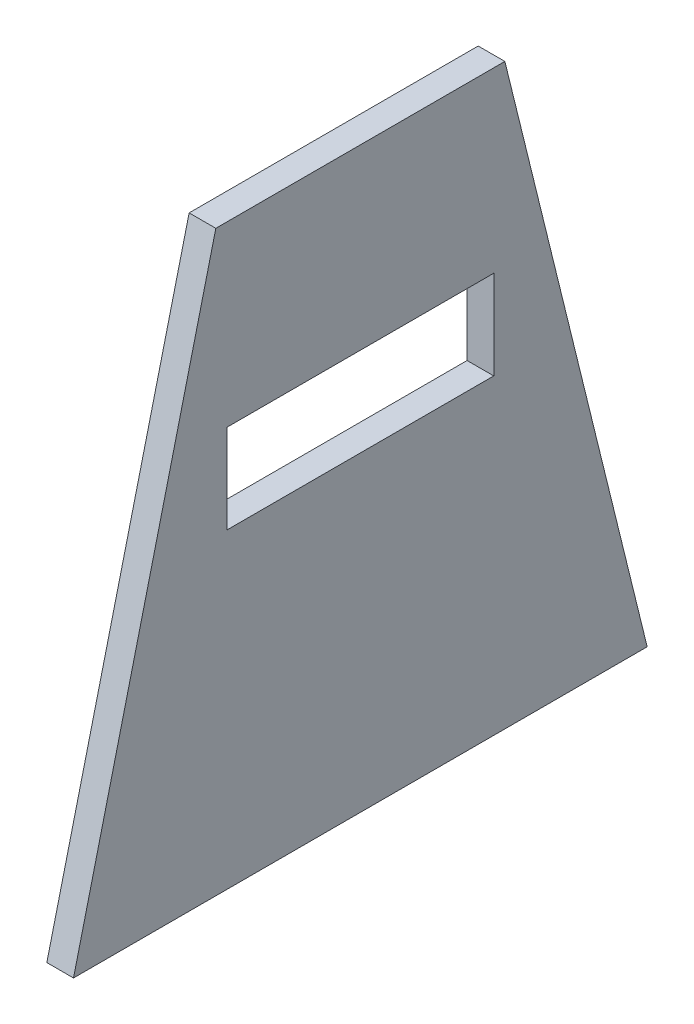
ISO-10303-21;
HEADER;
FILE_DESCRIPTION(('STEP AP214'),'2;1');
FILE_NAME('part.step','',(''),(''),'','','');
FILE_SCHEMA(('AUTOMOTIVE_DESIGN { 1 0 10303 214 1 1 1 1 }'));
ENDSEC;
DATA;
#1=APPLICATION_CONTEXT('core data for automotive mechanical design processes');
#2=APPLICATION_PROTOCOL_DEFINITION('international standard','automotive_design',2000,#1);
#3=PRODUCT_CONTEXT('',#1,'mechanical');
#4=PRODUCT('Part','Part','',(#3));
#5=PRODUCT_RELATED_PRODUCT_CATEGORY('part','',(#4));
#6=PRODUCT_DEFINITION_FORMATION('','',#4);
#7=PRODUCT_DEFINITION_CONTEXT('part definition',#1,'design');
#8=PRODUCT_DEFINITION('design','',#6,#7);
#9=PRODUCT_DEFINITION_SHAPE('','',#8);
#10=(LENGTH_UNIT() NAMED_UNIT(*) SI_UNIT(.MILLI.,.METRE.));
#11=(NAMED_UNIT(*) PLANE_ANGLE_UNIT() SI_UNIT($,.RADIAN.));
#12=(NAMED_UNIT(*) SI_UNIT($,.STERADIAN.) SOLID_ANGLE_UNIT());
#13=UNCERTAINTY_MEASURE_WITH_UNIT(LENGTH_MEASURE(1.E-05),#10,'distance_accuracy_value','');
#14=(GEOMETRIC_REPRESENTATION_CONTEXT(3) GLOBAL_UNCERTAINTY_ASSIGNED_CONTEXT((#13)) GLOBAL_UNIT_ASSIGNED_CONTEXT((#10,
#11,#12)) REPRESENTATION_CONTEXT('',''));
#15=CARTESIAN_POINT('',(0.,0.,0.));
#16=DIRECTION('',(0.,0.,1.));
#17=DIRECTION('',(1.,0.,0.));
#18=AXIS2_PLACEMENT_3D('',#15,#16,#17);
#19=CARTESIAN_POINT('',(3.,-45.,-32.25));
#20=DIRECTION('',(0.,-1.,0.));
#21=DIRECTION('',(0.,0.,-1.));
#22=AXIS2_PLACEMENT_3D('',#19,#20,#21);
#23=PLANE('',#22);
#24=DIRECTION('',(0.,0.,1.));
#25=VECTOR('',#24,1.);
#26=CARTESIAN_POINT('',(0.,-45.,-32.25));
#27=LINE('',#26,#25);
#28=CARTESIAN_POINT('',(0.,-45.,-32.25));
#29=VERTEX_POINT('',#28);
#30=CARTESIAN_POINT('',(0.,-45.,32.25));
#31=VERTEX_POINT('',#30);
#32=EDGE_CURVE('E136',#29,#31,#27,.T.);
#33=ORIENTED_EDGE('',*,*,#32,.F.);
#34=DIRECTION('',(-1.,0.,0.));
#35=VECTOR('',#34,1.);
#36=CARTESIAN_POINT('',(3.,-45.,-32.25));
#37=LINE('',#36,#35);
#38=CARTESIAN_POINT('',(3.,-45.,-32.25));
#39=VERTEX_POINT('',#38);
#40=EDGE_CURVE('E11',#39,#29,#37,.T.);
#41=ORIENTED_EDGE('',*,*,#40,.F.);
#42=DIRECTION('',(0.,0.,1.));
#43=VECTOR('',#42,1.);
#44=CARTESIAN_POINT('',(3.,-45.,-32.25));
#45=LINE('',#44,#43);
#46=CARTESIAN_POINT('',(3.,-45.,32.25));
#47=VERTEX_POINT('',#46);
#48=EDGE_CURVE('E140',#39,#47,#45,.T.);
#49=ORIENTED_EDGE('',*,*,#48,.T.);
#50=DIRECTION('',(-1.,0.,0.));
#51=VECTOR('',#50,1.);
#52=CARTESIAN_POINT('',(3.,-45.,32.25));
#53=LINE('',#52,#51);
#54=EDGE_CURVE('E41',#47,#31,#53,.T.);
#55=ORIENTED_EDGE('',*,*,#54,.T.);
#56=EDGE_LOOP('',(#33,#41,#49,#55));
#57=FACE_BOUND('',#56,.T.);
#58=ADVANCED_FACE('F38',(#57),#23,.T.);
#59=CARTESIAN_POINT('',(3.,20.,-16.25));
#60=DIRECTION('',(0.,0.239019047122404,-0.971014878934766));
#61=DIRECTION('',(0.,0.971014878934766,0.239019047122404));
#62=AXIS2_PLACEMENT_3D('',#59,#60,#61);
#63=PLANE('',#62);
#64=DIRECTION('',(0.,-0.971014878934766,-0.239019047122404));
#65=VECTOR('',#64,1.);
#66=CARTESIAN_POINT('',(0.,20.,-16.25));
#67=LINE('',#66,#65);
#68=CARTESIAN_POINT('',(0.,20.,-16.25));
#69=VERTEX_POINT('',#68);
#70=EDGE_CURVE('E144',#69,#29,#67,.T.);
#71=ORIENTED_EDGE('',*,*,#70,.F.);
#72=DIRECTION('',(-1.,0.,0.));
#73=VECTOR('',#72,1.);
#74=CARTESIAN_POINT('',(3.,20.,-16.25));
#75=LINE('',#74,#73);
#76=CARTESIAN_POINT('',(3.,20.,-16.25));
#77=VERTEX_POINT('',#76);
#78=EDGE_CURVE('E46',#77,#69,#75,.T.);
#79=ORIENTED_EDGE('',*,*,#78,.F.);
#80=DIRECTION('',(0.,-0.971014878934766,-0.239019047122404));
#81=VECTOR('',#80,1.);
#82=CARTESIAN_POINT('',(3.,20.,-16.25));
#83=LINE('',#82,#81);
#84=EDGE_CURVE('E150',#77,#39,#83,.T.);
#85=ORIENTED_EDGE('',*,*,#84,.T.);
#86=ORIENTED_EDGE('',*,*,#40,.T.);
#87=EDGE_LOOP('',(#71,#79,#85,#86));
#88=FACE_BOUND('',#87,.T.);
#89=ADVANCED_FACE('F174',(#88),#63,.T.);
#90=CARTESIAN_POINT('',(3.,20.,16.25));
#91=DIRECTION('',(0.,1.,0.));
#92=DIRECTION('',(0.,0.,1.));
#93=AXIS2_PLACEMENT_3D('',#90,#91,#92);
#94=PLANE('',#93);
#95=DIRECTION('',(0.,0.,-1.));
#96=VECTOR('',#95,1.);
#97=CARTESIAN_POINT('',(0.,20.,16.25));
#98=LINE('',#97,#96);
#99=CARTESIAN_POINT('',(0.,20.,16.25));
#100=VERTEX_POINT('',#99);
#101=EDGE_CURVE('E158',#100,#69,#98,.T.);
#102=ORIENTED_EDGE('',*,*,#101,.F.);
#103=DIRECTION('',(-1.,0.,0.));
#104=VECTOR('',#103,1.);
#105=CARTESIAN_POINT('',(3.,20.,16.25));
#106=LINE('',#105,#104);
#107=CARTESIAN_POINT('',(3.,20.,16.25));
#108=VERTEX_POINT('',#107);
#109=EDGE_CURVE('E163',#108,#100,#106,.T.);
#110=ORIENTED_EDGE('',*,*,#109,.F.);
#111=DIRECTION('',(0.,0.,-1.));
#112=VECTOR('',#111,1.);
#113=CARTESIAN_POINT('',(3.,20.,16.25));
#114=LINE('',#113,#112);
#115=EDGE_CURVE('E147',#108,#77,#114,.T.);
#116=ORIENTED_EDGE('',*,*,#115,.T.);
#117=ORIENTED_EDGE('',*,*,#78,.T.);
#118=EDGE_LOOP('',(#102,#110,#116,#117));
#119=FACE_BOUND('',#118,.T.);
#120=ADVANCED_FACE('F180',(#119),#94,.T.);
#121=CARTESIAN_POINT('',(3.,-45.,32.25));
#122=DIRECTION('',(0.,0.239019047122404,0.971014878934766));
#123=DIRECTION('',(0.,-0.971014878934766,0.239019047122404));
#124=AXIS2_PLACEMENT_3D('',#121,#122,#123);
#125=PLANE('',#124);
#126=DIRECTION('',(0.,0.971014878934766,-0.239019047122404));
#127=VECTOR('',#126,1.);
#128=CARTESIAN_POINT('',(0.,-45.,32.25));
#129=LINE('',#128,#127);
#130=EDGE_CURVE('E155',#31,#100,#129,.T.);
#131=ORIENTED_EDGE('',*,*,#130,.F.);
#132=ORIENTED_EDGE('',*,*,#54,.F.);
#133=DIRECTION('',(0.,0.971014878934766,-0.239019047122404));
#134=VECTOR('',#133,1.);
#135=CARTESIAN_POINT('',(3.,-45.,32.25));
#136=LINE('',#135,#134);
#137=EDGE_CURVE('E143',#47,#108,#136,.T.);
#138=ORIENTED_EDGE('',*,*,#137,.T.);
#139=ORIENTED_EDGE('',*,*,#109,.T.);
#140=EDGE_LOOP('',(#131,#132,#138,#139));
#141=FACE_BOUND('',#140,.T.);
#142=ADVANCED_FACE('F171',(#141),#125,.T.);
#143=CARTESIAN_POINT('',(3.,0.,0.));
#144=DIRECTION('',(-1.,0.,0.));
#145=DIRECTION('',(0.,0.,1.));
#146=AXIS2_PLACEMENT_3D('',#143,#144,#145);
#147=PLANE('',#146);
#148=DIRECTION('',(0.,0.,-1.));
#149=VECTOR('',#148,1.);
#150=CARTESIAN_POINT('',(3.,-10.,-15.));
#151=LINE('',#150,#149);
#152=CARTESIAN_POINT('',(3.,-10.,15.));
#153=VERTEX_POINT('',#152);
#154=CARTESIAN_POINT('',(3.,-10.,-15.));
#155=VERTEX_POINT('',#154);
#156=EDGE_CURVE('E130',#153,#155,#151,.T.);
#157=ORIENTED_EDGE('',*,*,#156,.F.);
#158=DIRECTION('',(0.,-1.,0.));
#159=VECTOR('',#158,1.);
#160=CARTESIAN_POINT('',(3.,-10.,15.));
#161=LINE('',#160,#159);
#162=CARTESIAN_POINT('',(3.,0.,15.));
#163=VERTEX_POINT('',#162);
#164=EDGE_CURVE('E54',#163,#153,#161,.T.);
#165=ORIENTED_EDGE('',*,*,#164,.F.);
#166=DIRECTION('',(0.,0.,1.));
#167=VECTOR('',#166,1.);
#168=CARTESIAN_POINT('',(3.,0.,-15.));
#169=LINE('',#168,#167);
#170=CARTESIAN_POINT('',(3.,0.,-15.));
#171=VERTEX_POINT('',#170);
#172=EDGE_CURVE('E121',#171,#163,#169,.T.);
#173=ORIENTED_EDGE('',*,*,#172,.F.);
#174=DIRECTION('',(0.,1.,0.));
#175=VECTOR('',#174,1.);
#176=CARTESIAN_POINT('',(3.,-10.,-15.));
#177=LINE('',#176,#175);
#178=EDGE_CURVE('E124',#155,#171,#177,.T.);
#179=ORIENTED_EDGE('',*,*,#178,.F.);
#180=EDGE_LOOP('',(#157,#165,#173,#179));
#181=FACE_BOUND('',#180,.T.);
#182=ORIENTED_EDGE('',*,*,#48,.F.);
#183=ORIENTED_EDGE('',*,*,#84,.F.);
#184=ORIENTED_EDGE('',*,*,#115,.F.);
#185=ORIENTED_EDGE('',*,*,#137,.F.);
#186=EDGE_LOOP('',(#182,#183,#184,#185));
#187=FACE_BOUND('',#186,.T.);
#188=ADVANCED_FACE('F177',(#181,#187),#147,.F.);
#189=CARTESIAN_POINT('',(0.,0.,0.));
#190=DIRECTION('',(-1.,0.,0.));
#191=DIRECTION('',(0.,0.,1.));
#192=AXIS2_PLACEMENT_3D('',#189,#190,#191);
#193=PLANE('',#192);
#194=DIRECTION('',(0.,-1.,0.));
#195=VECTOR('',#194,1.);
#196=CARTESIAN_POINT('',(0.,-10.,15.));
#197=LINE('',#196,#195);
#198=CARTESIAN_POINT('',(0.,0.,15.));
#199=VERTEX_POINT('',#198);
#200=CARTESIAN_POINT('',(0.,-10.,15.));
#201=VERTEX_POINT('',#200);
#202=EDGE_CURVE('E105',#199,#201,#197,.T.);
#203=ORIENTED_EDGE('',*,*,#202,.T.);
#204=DIRECTION('',(0.,0.,-1.));
#205=VECTOR('',#204,1.);
#206=CARTESIAN_POINT('',(0.,-10.,-15.));
#207=LINE('',#206,#205);
#208=CARTESIAN_POINT('',(0.,-10.,-15.));
#209=VERTEX_POINT('',#208);
#210=EDGE_CURVE('E114',#201,#209,#207,.T.);
#211=ORIENTED_EDGE('',*,*,#210,.T.);
#212=DIRECTION('',(0.,1.,0.));
#213=VECTOR('',#212,1.);
#214=CARTESIAN_POINT('',(0.,-10.,-15.));
#215=LINE('',#214,#213);
#216=CARTESIAN_POINT('',(0.,0.,-15.));
#217=VERTEX_POINT('',#216);
#218=EDGE_CURVE('E62',#209,#217,#215,.T.);
#219=ORIENTED_EDGE('',*,*,#218,.T.);
#220=DIRECTION('',(0.,0.,1.));
#221=VECTOR('',#220,1.);
#222=CARTESIAN_POINT('',(0.,0.,-15.));
#223=LINE('',#222,#221);
#224=EDGE_CURVE('E111',#217,#199,#223,.T.);
#225=ORIENTED_EDGE('',*,*,#224,.T.);
#226=EDGE_LOOP('',(#203,#211,#219,#225));
#227=FACE_BOUND('',#226,.T.);
#228=ORIENTED_EDGE('',*,*,#32,.T.);
#229=ORIENTED_EDGE('',*,*,#130,.T.);
#230=ORIENTED_EDGE('',*,*,#101,.T.);
#231=ORIENTED_EDGE('',*,*,#70,.T.);
#232=EDGE_LOOP('',(#228,#229,#230,#231));
#233=FACE_BOUND('',#232,.T.);
#234=ADVANCED_FACE('F118',(#227,#233),#193,.T.);
#235=CARTESIAN_POINT('',(0.,-10.,15.));
#236=DIRECTION('',(0.,0.,1.));
#237=DIRECTION('',(1.,0.,0.));
#238=AXIS2_PLACEMENT_3D('',#235,#236,#237);
#239=PLANE('',#238);
#240=ORIENTED_EDGE('',*,*,#164,.T.);
#241=DIRECTION('',(1.,0.,0.));
#242=VECTOR('',#241,1.);
#243=CARTESIAN_POINT('',(0.,-10.,15.));
#244=LINE('',#243,#242);
#245=EDGE_CURVE('E101',#201,#153,#244,.T.);
#246=ORIENTED_EDGE('',*,*,#245,.F.);
#247=ORIENTED_EDGE('',*,*,#202,.F.);
#248=DIRECTION('',(1.,0.,0.));
#249=VECTOR('',#248,1.);
#250=CARTESIAN_POINT('',(0.,0.,15.));
#251=LINE('',#250,#249);
#252=EDGE_CURVE('E134',#199,#163,#251,.T.);
#253=ORIENTED_EDGE('',*,*,#252,.T.);
#254=EDGE_LOOP('',(#240,#246,#247,#253));
#255=FACE_BOUND('',#254,.T.);
#256=ADVANCED_FACE('F103',(#255),#239,.F.);
#257=CARTESIAN_POINT('',(0.,0.,-15.));
#258=DIRECTION('',(0.,1.,0.));
#259=DIRECTION('',(0.,0.,1.));
#260=AXIS2_PLACEMENT_3D('',#257,#258,#259);
#261=PLANE('',#260);
#262=ORIENTED_EDGE('',*,*,#172,.T.);
#263=ORIENTED_EDGE('',*,*,#252,.F.);
#264=ORIENTED_EDGE('',*,*,#224,.F.);
#265=DIRECTION('',(1.,0.,0.));
#266=VECTOR('',#265,1.);
#267=CARTESIAN_POINT('',(0.,0.,-15.));
#268=LINE('',#267,#266);
#269=EDGE_CURVE('E137',#217,#171,#268,.T.);
#270=ORIENTED_EDGE('',*,*,#269,.T.);
#271=EDGE_LOOP('',(#262,#263,#264,#270));
#272=FACE_BOUND('',#271,.T.);
#273=ADVANCED_FACE('F231',(#272),#261,.F.);
#274=CARTESIAN_POINT('',(0.,-10.,-15.));
#275=DIRECTION('',(0.,0.,-1.));
#276=DIRECTION('',(0.,1.,0.));
#277=AXIS2_PLACEMENT_3D('',#274,#275,#276);
#278=PLANE('',#277);
#279=ORIENTED_EDGE('',*,*,#178,.T.);
#280=ORIENTED_EDGE('',*,*,#269,.F.);
#281=ORIENTED_EDGE('',*,*,#218,.F.);
#282=DIRECTION('',(1.,0.,0.));
#283=VECTOR('',#282,1.);
#284=CARTESIAN_POINT('',(0.,-10.,-15.));
#285=LINE('',#284,#283);
#286=EDGE_CURVE('E110',#209,#155,#285,.T.);
#287=ORIENTED_EDGE('',*,*,#286,.T.);
#288=EDGE_LOOP('',(#279,#280,#281,#287));
#289=FACE_BOUND('',#288,.T.);
#290=ADVANCED_FACE('F240',(#289),#278,.F.);
#291=CARTESIAN_POINT('',(0.,-10.,-15.));
#292=DIRECTION('',(0.,-1.,0.));
#293=DIRECTION('',(0.,0.,-1.));
#294=AXIS2_PLACEMENT_3D('',#291,#292,#293);
#295=PLANE('',#294);
#296=ORIENTED_EDGE('',*,*,#156,.T.);
#297=ORIENTED_EDGE('',*,*,#286,.F.);
#298=ORIENTED_EDGE('',*,*,#210,.F.);
#299=ORIENTED_EDGE('',*,*,#245,.T.);
#300=EDGE_LOOP('',(#296,#297,#298,#299));
#301=FACE_BOUND('',#300,.T.);
#302=ADVANCED_FACE('F115',(#301),#295,.F.);
#303=CLOSED_SHELL('',(#58,#89,#120,#142,#188,#234,#256,#273,#290,#302));
#304=MANIFOLD_SOLID_BREP('B2',#303);
#305=ADVANCED_BREP_SHAPE_REPRESENTATION('',(#18,#304),#14);
#306=SHAPE_DEFINITION_REPRESENTATION(#9,#305);
ENDSEC;
END-ISO-10303-21;
